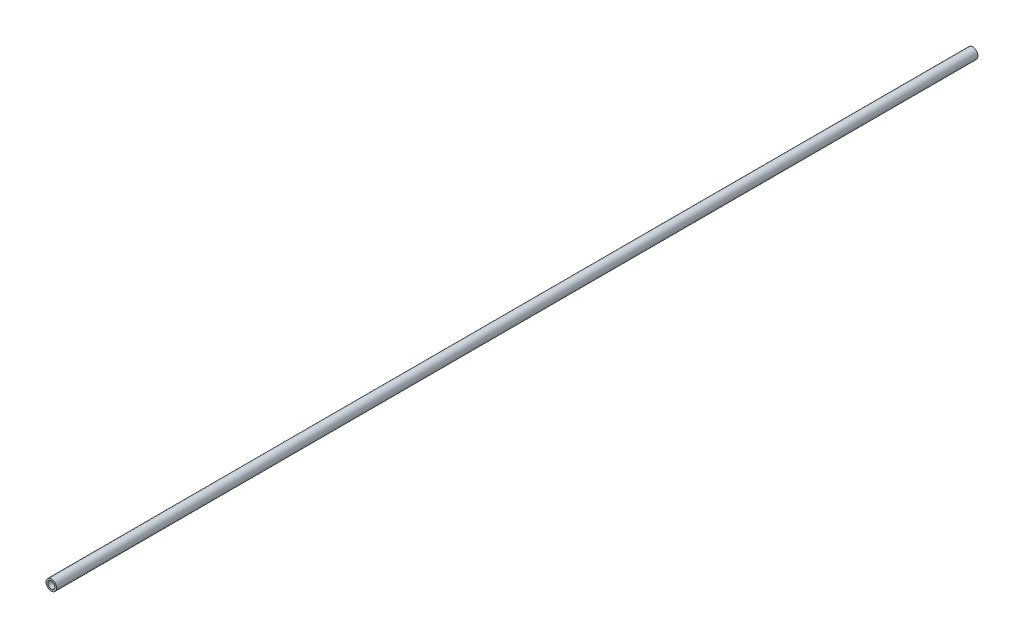
ISO-10303-21;
HEADER;
FILE_DESCRIPTION(('STEP AP214'),'2;1');
FILE_NAME('part.step','',(''),(''),'','','');
FILE_SCHEMA(('AUTOMOTIVE_DESIGN { 1 0 10303 214 1 1 1 1 }'));
ENDSEC;
DATA;
#1=APPLICATION_CONTEXT('core data for automotive mechanical design processes');
#2=APPLICATION_PROTOCOL_DEFINITION('international standard','automotive_design',2000,#1);
#3=PRODUCT_CONTEXT('',#1,'mechanical');
#4=PRODUCT('Part','Part','',(#3));
#5=PRODUCT_RELATED_PRODUCT_CATEGORY('part','',(#4));
#6=PRODUCT_DEFINITION_FORMATION('','',#4);
#7=PRODUCT_DEFINITION_CONTEXT('part definition',#1,'design');
#8=PRODUCT_DEFINITION('design','',#6,#7);
#9=PRODUCT_DEFINITION_SHAPE('','',#8);
#10=(LENGTH_UNIT() NAMED_UNIT(*) SI_UNIT(.MILLI.,.METRE.));
#11=(NAMED_UNIT(*) PLANE_ANGLE_UNIT() SI_UNIT($,.RADIAN.));
#12=(NAMED_UNIT(*) SI_UNIT($,.STERADIAN.) SOLID_ANGLE_UNIT());
#13=UNCERTAINTY_MEASURE_WITH_UNIT(LENGTH_MEASURE(1.E-05),#10,'distance_accuracy_value','');
#14=(GEOMETRIC_REPRESENTATION_CONTEXT(3) GLOBAL_UNCERTAINTY_ASSIGNED_CONTEXT((#13)) GLOBAL_UNIT_ASSIGNED_CONTEXT((#10,
#11,#12)) REPRESENTATION_CONTEXT('',''));
#15=CARTESIAN_POINT('',(0.,0.,0.));
#16=DIRECTION('',(0.,0.,1.));
#17=DIRECTION('',(1.,0.,0.));
#18=AXIS2_PLACEMENT_3D('',#15,#16,#17);
#19=CARTESIAN_POINT('',(0.,0.,1333.5));
#20=DIRECTION('',(0.,0.,1.));
#21=DIRECTION('',(1.,0.,0.));
#22=AXIS2_PLACEMENT_3D('',#19,#20,#21);
#23=PLANE('',#22);
#24=CARTESIAN_POINT('',(0.,0.,1333.5));
#25=DIRECTION('',(0.,0.,1.));
#26=DIRECTION('',(1.,0.,0.));
#27=AXIS2_PLACEMENT_3D('',#24,#25,#26);
#28=CIRCLE('',#27,7.62);
#29=CARTESIAN_POINT('',(7.62,0.,1333.5));
#30=VERTEX_POINT('',#29);
#31=EDGE_CURVE('E10',#30,#30,#28,.T.);
#32=ORIENTED_EDGE('',*,*,#31,.T.);
#33=EDGE_LOOP('',(#32));
#34=FACE_BOUND('',#33,.T.);
#35=CARTESIAN_POINT('',(0.,0.,1333.5));
#36=DIRECTION('',(0.,0.,1.));
#37=DIRECTION('',(1.,0.,0.));
#38=AXIS2_PLACEMENT_3D('',#35,#36,#37);
#39=CIRCLE('',#38,5.08);
#40=CARTESIAN_POINT('',(5.08,0.,1333.5));
#41=VERTEX_POINT('',#40);
#42=EDGE_CURVE('E41',#41,#41,#39,.T.);
#43=ORIENTED_EDGE('',*,*,#42,.F.);
#44=EDGE_LOOP('',(#43));
#45=FACE_BOUND('',#44,.T.);
#46=ADVANCED_FACE('F30',(#34,#45),#23,.T.);
#47=CARTESIAN_POINT('',(0.,0.,0.));
#48=DIRECTION('',(0.,0.,1.));
#49=DIRECTION('',(1.,0.,0.));
#50=AXIS2_PLACEMENT_3D('',#47,#48,#49);
#51=PLANE('',#50);
#52=CARTESIAN_POINT('',(0.,0.,0.));
#53=DIRECTION('',(0.,0.,1.));
#54=DIRECTION('',(1.,0.,0.));
#55=AXIS2_PLACEMENT_3D('',#52,#53,#54);
#56=CIRCLE('',#55,7.62);
#57=CARTESIAN_POINT('',(7.62,0.,0.));
#58=VERTEX_POINT('',#57);
#59=EDGE_CURVE('E34',#58,#58,#56,.T.);
#60=ORIENTED_EDGE('',*,*,#59,.F.);
#61=EDGE_LOOP('',(#60));
#62=FACE_BOUND('',#61,.T.);
#63=CARTESIAN_POINT('',(0.,0.,0.));
#64=DIRECTION('',(0.,0.,1.));
#65=DIRECTION('',(1.,0.,0.));
#66=AXIS2_PLACEMENT_3D('',#63,#64,#65);
#67=CIRCLE('',#66,5.08);
#68=CARTESIAN_POINT('',(5.08,0.,0.));
#69=VERTEX_POINT('',#68);
#70=EDGE_CURVE('E43',#69,#69,#67,.T.);
#71=ORIENTED_EDGE('',*,*,#70,.T.);
#72=EDGE_LOOP('',(#71));
#73=FACE_BOUND('',#72,.T.);
#74=ADVANCED_FACE('F53',(#62,#73),#51,.F.);
#75=CARTESIAN_POINT('',(0.,0.,1333.5));
#76=DIRECTION('',(0.,0.,-1.));
#77=DIRECTION('',(-1.,0.,0.));
#78=AXIS2_PLACEMENT_3D('',#75,#76,#77);
#79=CYLINDRICAL_SURFACE('',#78,7.62);
#80=ORIENTED_EDGE('',*,*,#31,.F.);
#81=EDGE_LOOP('',(#80));
#82=FACE_BOUND('',#81,.T.);
#83=ORIENTED_EDGE('',*,*,#59,.T.);
#84=EDGE_LOOP('',(#83));
#85=FACE_BOUND('',#84,.T.);
#86=ADVANCED_FACE('F32',(#82,#85),#79,.T.);
#87=CARTESIAN_POINT('',(0.,0.,1333.5));
#88=DIRECTION('',(0.,0.,-1.));
#89=DIRECTION('',(-1.,0.,0.));
#90=AXIS2_PLACEMENT_3D('',#87,#88,#89);
#91=CYLINDRICAL_SURFACE('',#90,5.08);
#92=ORIENTED_EDGE('',*,*,#42,.T.);
#93=EDGE_LOOP('',(#92));
#94=FACE_BOUND('',#93,.T.);
#95=ORIENTED_EDGE('',*,*,#70,.F.);
#96=EDGE_LOOP('',(#95));
#97=FACE_BOUND('',#96,.T.);
#98=ADVANCED_FACE('F49',(#94,#97),#91,.F.);
#99=CLOSED_SHELL('',(#46,#74,#86,#98));
#100=MANIFOLD_SOLID_BREP('B2',#99);
#101=ADVANCED_BREP_SHAPE_REPRESENTATION('',(#18,#100),#14);
#102=SHAPE_DEFINITION_REPRESENTATION(#9,#101);
ENDSEC;
END-ISO-10303-21;
